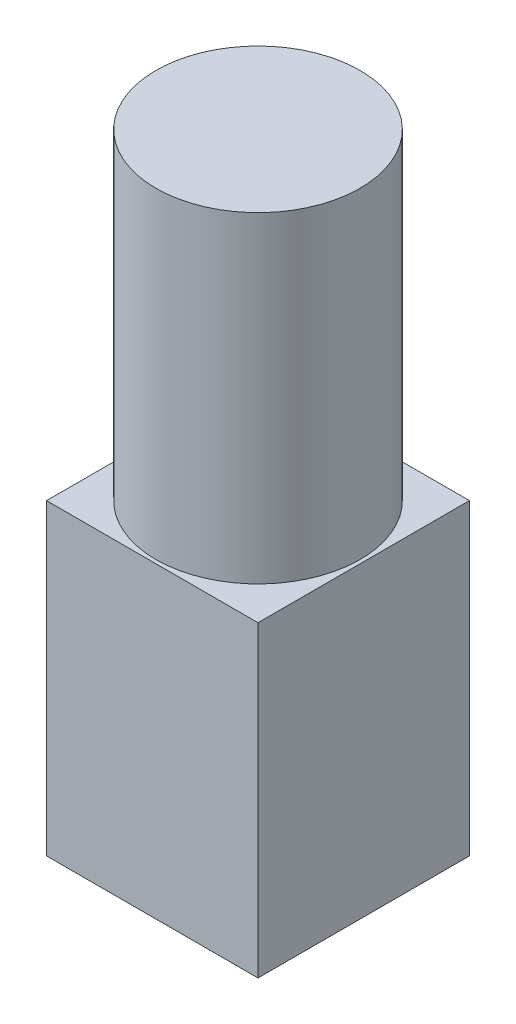
ISO-10303-21;
HEADER;
FILE_DESCRIPTION(('STEP AP214'),'2;1');
FILE_NAME('part.step','',(''),(''),'','','');
FILE_SCHEMA(('AUTOMOTIVE_DESIGN { 1 0 10303 214 1 1 1 1 }'));
ENDSEC;
DATA;
#1=APPLICATION_CONTEXT('core data for automotive mechanical design processes');
#2=APPLICATION_PROTOCOL_DEFINITION('international standard','automotive_design',2000,#1);
#3=PRODUCT_CONTEXT('',#1,'mechanical');
#4=PRODUCT('Part','Part','',(#3));
#5=PRODUCT_RELATED_PRODUCT_CATEGORY('part','',(#4));
#6=PRODUCT_DEFINITION_FORMATION('','',#4);
#7=PRODUCT_DEFINITION_CONTEXT('part definition',#1,'design');
#8=PRODUCT_DEFINITION('design','',#6,#7);
#9=PRODUCT_DEFINITION_SHAPE('','',#8);
#10=(LENGTH_UNIT() NAMED_UNIT(*) SI_UNIT(.MILLI.,.METRE.));
#11=(NAMED_UNIT(*) PLANE_ANGLE_UNIT() SI_UNIT($,.RADIAN.));
#12=(NAMED_UNIT(*) SI_UNIT($,.STERADIAN.) SOLID_ANGLE_UNIT());
#13=UNCERTAINTY_MEASURE_WITH_UNIT(LENGTH_MEASURE(1.E-05),#10,'distance_accuracy_value','');
#14=(GEOMETRIC_REPRESENTATION_CONTEXT(3) GLOBAL_UNCERTAINTY_ASSIGNED_CONTEXT((#13)) GLOBAL_UNIT_ASSIGNED_CONTEXT((#10,
#11,#12)) REPRESENTATION_CONTEXT('',''));
#15=CARTESIAN_POINT('',(0.,0.,0.));
#16=DIRECTION('',(0.,0.,1.));
#17=DIRECTION('',(1.,0.,0.));
#18=AXIS2_PLACEMENT_3D('',#15,#16,#17);
#19=CARTESIAN_POINT('',(0.,42.2,0.));
#20=DIRECTION('',(1.,0.,0.));
#21=DIRECTION('',(0.,0.,-1.));
#22=AXIS2_PLACEMENT_3D('',#19,#20,#21);
#23=PLANE('',#22);
#24=DIRECTION('',(0.,0.,1.));
#25=VECTOR('',#24,1.);
#26=CARTESIAN_POINT('',(0.,0.,0.));
#27=LINE('',#26,#25);
#28=CARTESIAN_POINT('',(0.,0.,0.));
#29=VERTEX_POINT('',#28);
#30=CARTESIAN_POINT('',(0.,0.,29.));
#31=VERTEX_POINT('',#30);
#32=EDGE_CURVE('E102',#29,#31,#27,.T.);
#33=ORIENTED_EDGE('',*,*,#32,.T.);
#34=DIRECTION('',(0.,-1.,0.));
#35=VECTOR('',#34,1.);
#36=CARTESIAN_POINT('',(0.,42.2,29.));
#37=LINE('',#36,#35);
#38=CARTESIAN_POINT('',(0.,42.2,29.));
#39=VERTEX_POINT('',#38);
#40=EDGE_CURVE('E39',#39,#31,#37,.T.);
#41=ORIENTED_EDGE('',*,*,#40,.F.);
#42=DIRECTION('',(0.,0.,1.));
#43=VECTOR('',#42,1.);
#44=CARTESIAN_POINT('',(0.,42.2,0.));
#45=LINE('',#44,#43);
#46=CARTESIAN_POINT('',(0.,42.2,0.));
#47=VERTEX_POINT('',#46);
#48=EDGE_CURVE('E89',#47,#39,#45,.T.);
#49=ORIENTED_EDGE('',*,*,#48,.F.);
#50=DIRECTION('',(0.,-1.,0.));
#51=VECTOR('',#50,1.);
#52=CARTESIAN_POINT('',(0.,42.2,0.));
#53=LINE('',#52,#51);
#54=EDGE_CURVE('E98',#47,#29,#53,.T.);
#55=ORIENTED_EDGE('',*,*,#54,.T.);
#56=EDGE_LOOP('',(#33,#41,#49,#55));
#57=FACE_BOUND('',#56,.T.);
#58=ADVANCED_FACE('F36',(#57),#23,.F.);
#59=CARTESIAN_POINT('',(0.,42.2,29.));
#60=DIRECTION('',(0.,0.,-1.));
#61=DIRECTION('',(-1.,0.,0.));
#62=AXIS2_PLACEMENT_3D('',#59,#60,#61);
#63=PLANE('',#62);
#64=DIRECTION('',(1.,0.,0.));
#65=VECTOR('',#64,1.);
#66=CARTESIAN_POINT('',(0.,0.,29.));
#67=LINE('',#66,#65);
#68=CARTESIAN_POINT('',(29.,0.,29.));
#69=VERTEX_POINT('',#68);
#70=EDGE_CURVE('E94',#31,#69,#67,.T.);
#71=ORIENTED_EDGE('',*,*,#70,.T.);
#72=DIRECTION('',(0.,-1.,0.));
#73=VECTOR('',#72,1.);
#74=CARTESIAN_POINT('',(29.,42.2,29.));
#75=LINE('',#74,#73);
#76=CARTESIAN_POINT('',(29.,42.2,29.));
#77=VERTEX_POINT('',#76);
#78=EDGE_CURVE('E92',#77,#69,#75,.T.);
#79=ORIENTED_EDGE('',*,*,#78,.F.);
#80=DIRECTION('',(1.,0.,0.));
#81=VECTOR('',#80,1.);
#82=CARTESIAN_POINT('',(0.,42.2,29.));
#83=LINE('',#82,#81);
#84=EDGE_CURVE('E84',#39,#77,#83,.T.);
#85=ORIENTED_EDGE('',*,*,#84,.F.);
#86=ORIENTED_EDGE('',*,*,#40,.T.);
#87=EDGE_LOOP('',(#71,#79,#85,#86));
#88=FACE_BOUND('',#87,.T.);
#89=ADVANCED_FACE('F93',(#88),#63,.F.);
#90=CARTESIAN_POINT('',(29.,42.2,0.));
#91=DIRECTION('',(-1.,0.,0.));
#92=DIRECTION('',(0.,0.,1.));
#93=AXIS2_PLACEMENT_3D('',#90,#91,#92);
#94=PLANE('',#93);
#95=DIRECTION('',(0.,0.,-1.));
#96=VECTOR('',#95,1.);
#97=CARTESIAN_POINT('',(29.,0.,0.));
#98=LINE('',#97,#96);
#99=CARTESIAN_POINT('',(29.,0.,0.));
#100=VERTEX_POINT('',#99);
#101=EDGE_CURVE('E70',#69,#100,#98,.T.);
#102=ORIENTED_EDGE('',*,*,#101,.T.);
#103=DIRECTION('',(0.,-1.,0.));
#104=VECTOR('',#103,1.);
#105=CARTESIAN_POINT('',(29.,42.2,0.));
#106=LINE('',#105,#104);
#107=CARTESIAN_POINT('',(29.,42.2,0.));
#108=VERTEX_POINT('',#107);
#109=EDGE_CURVE('E95',#108,#100,#106,.T.);
#110=ORIENTED_EDGE('',*,*,#109,.F.);
#111=DIRECTION('',(0.,0.,-1.));
#112=VECTOR('',#111,1.);
#113=CARTESIAN_POINT('',(29.,42.2,0.));
#114=LINE('',#113,#112);
#115=EDGE_CURVE('E87',#77,#108,#114,.T.);
#116=ORIENTED_EDGE('',*,*,#115,.F.);
#117=ORIENTED_EDGE('',*,*,#78,.T.);
#118=EDGE_LOOP('',(#102,#110,#116,#117));
#119=FACE_BOUND('',#118,.T.);
#120=ADVANCED_FACE('F96',(#119),#94,.F.);
#121=CARTESIAN_POINT('',(0.,42.2,0.));
#122=DIRECTION('',(0.,0.,1.));
#123=DIRECTION('',(1.,0.,0.));
#124=AXIS2_PLACEMENT_3D('',#121,#122,#123);
#125=PLANE('',#124);
#126=DIRECTION('',(-1.,0.,0.));
#127=VECTOR('',#126,1.);
#128=CARTESIAN_POINT('',(0.,0.,0.));
#129=LINE('',#128,#127);
#130=EDGE_CURVE('E76',#100,#29,#129,.T.);
#131=ORIENTED_EDGE('',*,*,#130,.T.);
#132=ORIENTED_EDGE('',*,*,#54,.F.);
#133=DIRECTION('',(-1.,0.,0.));
#134=VECTOR('',#133,1.);
#135=CARTESIAN_POINT('',(0.,42.2,0.));
#136=LINE('',#135,#134);
#137=EDGE_CURVE('E53',#108,#47,#136,.T.);
#138=ORIENTED_EDGE('',*,*,#137,.F.);
#139=ORIENTED_EDGE('',*,*,#109,.T.);
#140=EDGE_LOOP('',(#131,#132,#138,#139));
#141=FACE_BOUND('',#140,.T.);
#142=ADVANCED_FACE('F110',(#141),#125,.F.);
#143=CARTESIAN_POINT('',(0.,42.2,0.));
#144=DIRECTION('',(0.,1.,0.));
#145=DIRECTION('',(0.,0.,1.));
#146=AXIS2_PLACEMENT_3D('',#143,#144,#145);
#147=PLANE('',#146);
#148=CARTESIAN_POINT('',(14.5,42.2,14.5));
#149=DIRECTION('',(0.,1.,0.));
#150=DIRECTION('',(0.,0.,1.));
#151=AXIS2_PLACEMENT_3D('',#148,#149,#150);
#152=CIRCLE('',#151,14.);
#153=CARTESIAN_POINT('',(14.5,42.2,28.5));
#154=VERTEX_POINT('',#153);
#155=EDGE_CURVE('E11',#154,#154,#152,.T.);
#156=ORIENTED_EDGE('',*,*,#155,.F.);
#157=EDGE_LOOP('',(#156));
#158=FACE_BOUND('',#157,.T.);
#159=ORIENTED_EDGE('',*,*,#48,.T.);
#160=ORIENTED_EDGE('',*,*,#84,.T.);
#161=ORIENTED_EDGE('',*,*,#115,.T.);
#162=ORIENTED_EDGE('',*,*,#137,.T.);
#163=EDGE_LOOP('',(#159,#160,#161,#162));
#164=FACE_BOUND('',#163,.T.);
#165=ADVANCED_FACE('F85',(#158,#164),#147,.T.);
#166=CARTESIAN_POINT('',(0.,0.,0.));
#167=DIRECTION('',(0.,1.,0.));
#168=DIRECTION('',(0.,0.,1.));
#169=AXIS2_PLACEMENT_3D('',#166,#167,#168);
#170=PLANE('',#169);
#171=ORIENTED_EDGE('',*,*,#32,.F.);
#172=ORIENTED_EDGE('',*,*,#130,.F.);
#173=ORIENTED_EDGE('',*,*,#101,.F.);
#174=ORIENTED_EDGE('',*,*,#70,.F.);
#175=EDGE_LOOP('',(#171,#172,#173,#174));
#176=FACE_BOUND('',#175,.T.);
#177=ADVANCED_FACE('F113',(#176),#170,.F.);
#178=CARTESIAN_POINT('',(14.5,86.3,14.5));
#179=DIRECTION('',(0.,-1.,0.));
#180=DIRECTION('',(0.,0.,-1.));
#181=AXIS2_PLACEMENT_3D('',#178,#179,#180);
#182=CYLINDRICAL_SURFACE('',#181,14.);
#183=CARTESIAN_POINT('',(14.5,86.3,14.5));
#184=DIRECTION('',(0.,1.,0.));
#185=DIRECTION('',(0.,0.,1.));
#186=AXIS2_PLACEMENT_3D('',#183,#184,#185);
#187=CIRCLE('',#186,14.);
#188=CARTESIAN_POINT('',(14.5,86.3,28.5));
#189=VERTEX_POINT('',#188);
#190=EDGE_CURVE('E105',#189,#189,#187,.T.);
#191=ORIENTED_EDGE('',*,*,#190,.F.);
#192=EDGE_LOOP('',(#191));
#193=FACE_BOUND('',#192,.T.);
#194=ORIENTED_EDGE('',*,*,#155,.T.);
#195=EDGE_LOOP('',(#194));
#196=FACE_BOUND('',#195,.T.);
#197=ADVANCED_FACE('F121',(#193,#196),#182,.T.);
#198=CARTESIAN_POINT('',(14.5,86.3,14.5));
#199=DIRECTION('',(0.,1.,0.));
#200=DIRECTION('',(0.,0.,1.));
#201=AXIS2_PLACEMENT_3D('',#198,#199,#200);
#202=PLANE('',#201);
#203=ORIENTED_EDGE('',*,*,#190,.T.);
#204=EDGE_LOOP('',(#203));
#205=FACE_BOUND('',#204,.T.);
#206=ADVANCED_FACE('F119',(#205),#202,.T.);
#207=CLOSED_SHELL('',(#58,#89,#120,#142,#165,#177,#197,#206));
#208=MANIFOLD_SOLID_BREP('B2',#207);
#209=ADVANCED_BREP_SHAPE_REPRESENTATION('',(#18,#208),#14);
#210=SHAPE_DEFINITION_REPRESENTATION(#9,#209);
ENDSEC;
END-ISO-10303-21;
